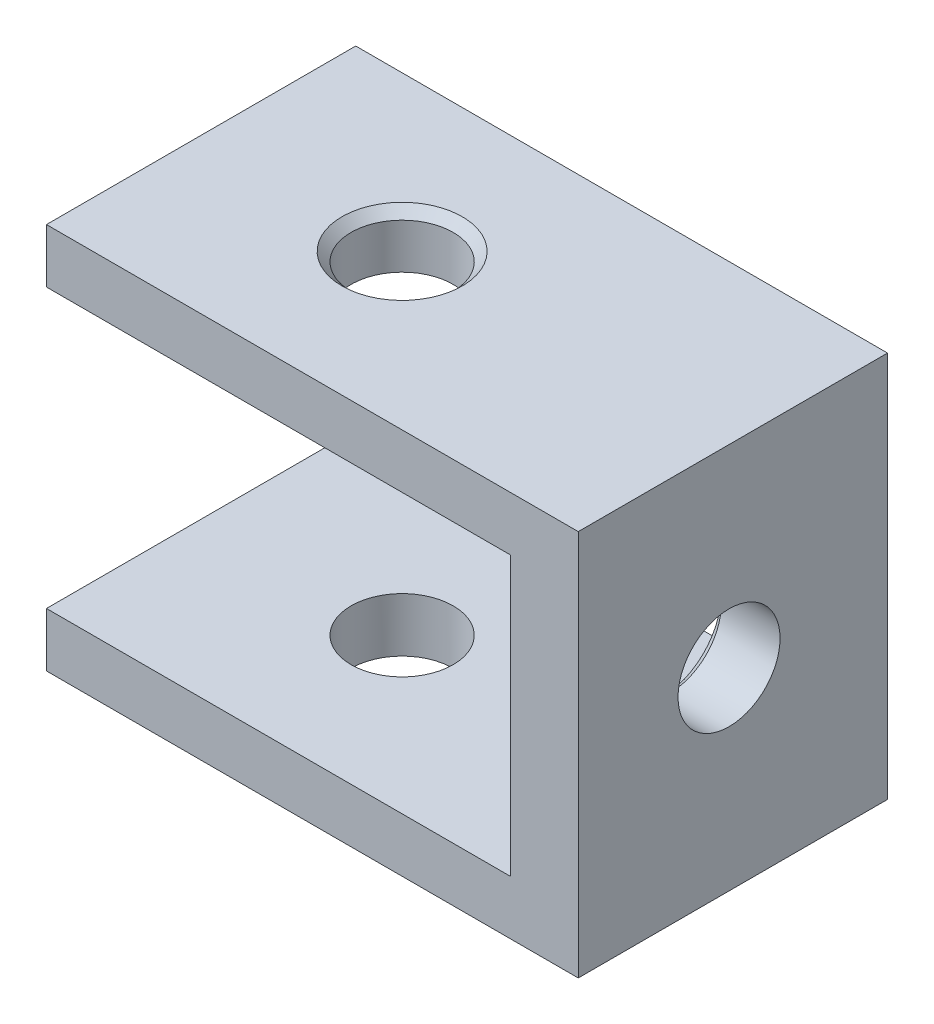
ISO-10303-21;
HEADER;
FILE_DESCRIPTION(('STEP AP214'),'2;1');
FILE_NAME('part.step','',(''),(''),'','','');
FILE_SCHEMA(('AUTOMOTIVE_DESIGN { 1 0 10303 214 1 1 1 1 }'));
ENDSEC;
DATA;
#1=APPLICATION_CONTEXT('core data for automotive mechanical design processes');
#2=APPLICATION_PROTOCOL_DEFINITION('international standard','automotive_design',2000,#1);
#3=PRODUCT_CONTEXT('',#1,'mechanical');
#4=PRODUCT('Part','Part','',(#3));
#5=PRODUCT_RELATED_PRODUCT_CATEGORY('part','',(#4));
#6=PRODUCT_DEFINITION_FORMATION('','',#4);
#7=PRODUCT_DEFINITION_CONTEXT('part definition',#1,'design');
#8=PRODUCT_DEFINITION('design','',#6,#7);
#9=PRODUCT_DEFINITION_SHAPE('','',#8);
#10=(LENGTH_UNIT() NAMED_UNIT(*) SI_UNIT(.MILLI.,.METRE.));
#11=(NAMED_UNIT(*) PLANE_ANGLE_UNIT() SI_UNIT($,.RADIAN.));
#12=(NAMED_UNIT(*) SI_UNIT($,.STERADIAN.) SOLID_ANGLE_UNIT());
#13=UNCERTAINTY_MEASURE_WITH_UNIT(LENGTH_MEASURE(1.E-05),#10,'distance_accuracy_value','');
#14=(GEOMETRIC_REPRESENTATION_CONTEXT(3) GLOBAL_UNCERTAINTY_ASSIGNED_CONTEXT((#13)) GLOBAL_UNIT_ASSIGNED_CONTEXT((#10,
#11,#12)) REPRESENTATION_CONTEXT('',''));
#15=CARTESIAN_POINT('',(0.,0.,0.));
#16=DIRECTION('',(0.,0.,1.));
#17=DIRECTION('',(1.,0.,0.));
#18=AXIS2_PLACEMENT_3D('',#15,#16,#17);
#19=CARTESIAN_POINT('',(-49.3903002128406,25.,9.75048362135415));
#20=DIRECTION('',(0.,0.,-1.));
#21=DIRECTION('',(-1.,0.,0.));
#22=AXIS2_PLACEMENT_3D('',#19,#20,#21);
#23=PLANE('',#22);
#24=DIRECTION('',(0.,1.,0.));
#25=VECTOR('',#24,1.);
#26=CARTESIAN_POINT('',(-15.,0.,9.75048362135415));
#27=LINE('',#26,#25);
#28=CARTESIAN_POINT('',(-15.,0.,9.75048362135415));
#29=VERTEX_POINT('',#28);
#30=CARTESIAN_POINT('',(-15.,25.,9.75048362135415));
#31=VERTEX_POINT('',#30);
#32=EDGE_CURVE('E56',#29,#31,#27,.T.);
#33=ORIENTED_EDGE('',*,*,#32,.T.);
#34=DIRECTION('',(1.,0.,0.));
#35=VECTOR('',#34,1.);
#36=CARTESIAN_POINT('',(-49.3903002128406,25.,9.75048362135415));
#37=LINE('',#36,#35);
#38=CARTESIAN_POINT('',(-49.3903002128406,25.,9.75048362135415));
#39=VERTEX_POINT('',#38);
#40=EDGE_CURVE('E116',#39,#31,#37,.T.);
#41=ORIENTED_EDGE('',*,*,#40,.F.);
#42=DIRECTION('',(0.,-1.,0.));
#43=VECTOR('',#42,1.);
#44=CARTESIAN_POINT('',(-49.3903002128406,25.,9.75048362135415));
#45=LINE('',#44,#43);
#46=CARTESIAN_POINT('',(-49.3903002128406,21.5,9.75048362135415));
#47=VERTEX_POINT('',#46);
#48=EDGE_CURVE('E49',#39,#47,#45,.T.);
#49=ORIENTED_EDGE('',*,*,#48,.T.);
#50=DIRECTION('',(-1.,0.,0.));
#51=VECTOR('',#50,1.);
#52=CARTESIAN_POINT('',(-19.3903002128406,21.5,9.75048362135415));
#53=LINE('',#52,#51);
#54=CARTESIAN_POINT('',(-19.3903002128406,21.5,9.75048362135415));
#55=VERTEX_POINT('',#54);
#56=EDGE_CURVE('E179',#55,#47,#53,.T.);
#57=ORIENTED_EDGE('',*,*,#56,.F.);
#58=DIRECTION('',(0.,1.,0.));
#59=VECTOR('',#58,1.);
#60=CARTESIAN_POINT('',(-19.3903002128406,21.5,9.75048362135415));
#61=LINE('',#60,#59);
#62=CARTESIAN_POINT('',(-19.3903002128406,3.5,9.75048362135415));
#63=VERTEX_POINT('',#62);
#64=EDGE_CURVE('E171',#63,#55,#61,.T.);
#65=ORIENTED_EDGE('',*,*,#64,.F.);
#66=DIRECTION('',(-1.,0.,0.));
#67=VECTOR('',#66,1.);
#68=CARTESIAN_POINT('',(-19.3903002128406,3.5,9.75048362135415));
#69=LINE('',#68,#67);
#70=CARTESIAN_POINT('',(-49.3903002128406,3.5,9.75048362135415));
#71=VERTEX_POINT('',#70);
#72=EDGE_CURVE('E181',#63,#71,#69,.T.);
#73=ORIENTED_EDGE('',*,*,#72,.T.);
#74=CARTESIAN_POINT('',(-49.3903002128406,0.,9.75048362135415));
#75=VERTEX_POINT('',#74);
#76=EDGE_CURVE('E143',#71,#75,#45,.T.);
#77=ORIENTED_EDGE('',*,*,#76,.T.);
#78=DIRECTION('',(1.,0.,0.));
#79=VECTOR('',#78,1.);
#80=CARTESIAN_POINT('',(-49.3903002128406,0.,9.75048362135415));
#81=LINE('',#80,#79);
#82=EDGE_CURVE('E119',#75,#29,#81,.T.);
#83=ORIENTED_EDGE('',*,*,#82,.T.);
#84=EDGE_LOOP('',(#33,#41,#49,#57,#65,#73,#77,#83));
#85=FACE_BOUND('',#84,.T.);
#86=ADVANCED_FACE('F40',(#85),#23,.F.);
#87=CARTESIAN_POINT('',(-49.3903002128406,25.,-10.2495163786458));
#88=DIRECTION('',(0.,0.,1.));
#89=DIRECTION('',(1.,0.,0.));
#90=AXIS2_PLACEMENT_3D('',#87,#88,#89);
#91=PLANE('',#90);
#92=DIRECTION('',(0.,1.,0.));
#93=VECTOR('',#92,1.);
#94=CARTESIAN_POINT('',(-15.,25.,-10.2495163786458));
#95=LINE('',#94,#93);
#96=CARTESIAN_POINT('',(-15.,0.,-10.2495163786458));
#97=VERTEX_POINT('',#96);
#98=CARTESIAN_POINT('',(-15.,25.,-10.2495163786458));
#99=VERTEX_POINT('',#98);
#100=EDGE_CURVE('E108',#97,#99,#95,.T.);
#101=ORIENTED_EDGE('',*,*,#100,.F.);
#102=DIRECTION('',(-1.,0.,0.));
#103=VECTOR('',#102,1.);
#104=CARTESIAN_POINT('',(-49.3903002128406,0.,-10.2495163786458));
#105=LINE('',#104,#103);
#106=CARTESIAN_POINT('',(-49.3903002128406,0.,-10.2495163786458));
#107=VERTEX_POINT('',#106);
#108=EDGE_CURVE('E130',#97,#107,#105,.T.);
#109=ORIENTED_EDGE('',*,*,#108,.T.);
#110=DIRECTION('',(0.,-1.,0.));
#111=VECTOR('',#110,1.);
#112=CARTESIAN_POINT('',(-49.3903002128406,25.,-10.2495163786458));
#113=LINE('',#112,#111);
#114=CARTESIAN_POINT('',(-49.3903002128406,3.5,-10.2495163786458));
#115=VERTEX_POINT('',#114);
#116=EDGE_CURVE('E128',#115,#107,#113,.T.);
#117=ORIENTED_EDGE('',*,*,#116,.F.);
#118=DIRECTION('',(-1.,0.,0.));
#119=VECTOR('',#118,1.);
#120=CARTESIAN_POINT('',(-19.3903002128406,3.5,-10.2495163786458));
#121=LINE('',#120,#119);
#122=CARTESIAN_POINT('',(-19.3903002128406,3.5,-10.2495163786458));
#123=VERTEX_POINT('',#122);
#124=EDGE_CURVE('E174',#123,#115,#121,.T.);
#125=ORIENTED_EDGE('',*,*,#124,.F.);
#126=DIRECTION('',(0.,-1.,0.));
#127=VECTOR('',#126,1.);
#128=CARTESIAN_POINT('',(-19.3903002128406,12.5,-10.2495163786458));
#129=LINE('',#128,#127);
#130=CARTESIAN_POINT('',(-19.3903002128406,21.5,-10.2495163786458));
#131=VERTEX_POINT('',#130);
#132=EDGE_CURVE('E165',#131,#123,#129,.T.);
#133=ORIENTED_EDGE('',*,*,#132,.F.);
#134=DIRECTION('',(-1.,0.,0.));
#135=VECTOR('',#134,1.);
#136=CARTESIAN_POINT('',(-19.3903002128406,21.5,-10.2495163786458));
#137=LINE('',#136,#135);
#138=CARTESIAN_POINT('',(-49.3903002128406,21.5,-10.2495163786458));
#139=VERTEX_POINT('',#138);
#140=EDGE_CURVE('E137',#131,#139,#137,.T.);
#141=ORIENTED_EDGE('',*,*,#140,.T.);
#142=CARTESIAN_POINT('',(-49.3903002128406,25.,-10.2495163786458));
#143=VERTEX_POINT('',#142);
#144=EDGE_CURVE('E140',#143,#139,#113,.T.);
#145=ORIENTED_EDGE('',*,*,#144,.F.);
#146=DIRECTION('',(-1.,0.,0.));
#147=VECTOR('',#146,1.);
#148=CARTESIAN_POINT('',(-49.3903002128406,25.,-10.2495163786458));
#149=LINE('',#148,#147);
#150=EDGE_CURVE('E126',#99,#143,#149,.T.);
#151=ORIENTED_EDGE('',*,*,#150,.F.);
#152=EDGE_LOOP('',(#101,#109,#117,#125,#133,#141,#145,#151));
#153=FACE_BOUND('',#152,.T.);
#154=ADVANCED_FACE('F194',(#153),#91,.F.);
#155=CARTESIAN_POINT('',(0.,25.,0.));
#156=DIRECTION('',(0.,1.,0.));
#157=DIRECTION('',(0.,0.,1.));
#158=AXIS2_PLACEMENT_3D('',#155,#156,#157);
#159=PLANE('',#158);
#160=CARTESIAN_POINT('',(-36.3903002128406,25.,-0.249516378645847));
#161=DIRECTION('',(0.,1.,0.));
#162=DIRECTION('',(0.,0.,1.));
#163=AXIS2_PLACEMENT_3D('',#160,#161,#162);
#164=CIRCLE('',#163,3.8865);
#165=CARTESIAN_POINT('',(-36.3903002128406,25.,3.63698362135415));
#166=VERTEX_POINT('',#165);
#167=EDGE_CURVE('E153',#166,#166,#164,.T.);
#168=ORIENTED_EDGE('',*,*,#167,.F.);
#169=EDGE_LOOP('',(#168));
#170=FACE_BOUND('',#169,.T.);
#171=ORIENTED_EDGE('',*,*,#40,.T.);
#172=DIRECTION('',(0.,0.,1.));
#173=VECTOR('',#172,1.);
#174=CARTESIAN_POINT('',(-15.,25.,-20.2495163786458));
#175=LINE('',#174,#173);
#176=EDGE_CURVE('E105',#99,#31,#175,.T.);
#177=ORIENTED_EDGE('',*,*,#176,.F.);
#178=ORIENTED_EDGE('',*,*,#150,.T.);
#179=DIRECTION('',(0.,0.,1.));
#180=VECTOR('',#179,1.);
#181=CARTESIAN_POINT('',(-49.3903002128406,25.,-10.2495163786458));
#182=LINE('',#181,#180);
#183=EDGE_CURVE('E124',#143,#39,#182,.T.);
#184=ORIENTED_EDGE('',*,*,#183,.T.);
#185=EDGE_LOOP('',(#171,#177,#178,#184));
#186=FACE_BOUND('',#185,.T.);
#187=ADVANCED_FACE('F122',(#170,#186),#159,.T.);
#188=CARTESIAN_POINT('',(0.,0.,0.));
#189=DIRECTION('',(0.,1.,0.));
#190=DIRECTION('',(0.,0.,1.));
#191=AXIS2_PLACEMENT_3D('',#188,#189,#190);
#192=PLANE('',#191);
#193=CARTESIAN_POINT('',(-36.3903002128406,0.,-0.249516378645847));
#194=DIRECTION('',(0.,1.,0.));
#195=DIRECTION('',(0.,0.,1.));
#196=AXIS2_PLACEMENT_3D('',#193,#194,#195);
#197=CIRCLE('',#196,3.3);
#198=CARTESIAN_POINT('',(-36.3903002128406,0.,3.05048362135415));
#199=VERTEX_POINT('',#198);
#200=EDGE_CURVE('E120',#199,#199,#197,.T.);
#201=ORIENTED_EDGE('',*,*,#200,.T.);
#202=EDGE_LOOP('',(#201));
#203=FACE_BOUND('',#202,.T.);
#204=DIRECTION('',(0.,0.,-1.));
#205=VECTOR('',#204,1.);
#206=CARTESIAN_POINT('',(-15.,0.,0.));
#207=LINE('',#206,#205);
#208=EDGE_CURVE('E11',#29,#97,#207,.T.);
#209=ORIENTED_EDGE('',*,*,#208,.F.);
#210=ORIENTED_EDGE('',*,*,#82,.F.);
#211=DIRECTION('',(0.,0.,1.));
#212=VECTOR('',#211,1.);
#213=CARTESIAN_POINT('',(-49.3903002128406,0.,-10.2495163786458));
#214=LINE('',#213,#212);
#215=EDGE_CURVE('E134',#107,#75,#214,.T.);
#216=ORIENTED_EDGE('',*,*,#215,.F.);
#217=ORIENTED_EDGE('',*,*,#108,.F.);
#218=EDGE_LOOP('',(#209,#210,#216,#217));
#219=FACE_BOUND('',#218,.T.);
#220=ADVANCED_FACE('F197',(#203,#219),#192,.F.);
#221=CARTESIAN_POINT('',(-49.3903002128406,25.,-10.2495163786458));
#222=DIRECTION('',(1.,0.,0.));
#223=DIRECTION('',(0.,0.,-1.));
#224=AXIS2_PLACEMENT_3D('',#221,#222,#223);
#225=PLANE('',#224);
#226=ORIENTED_EDGE('',*,*,#144,.T.);
#227=DIRECTION('',(0.,0.,-1.));
#228=VECTOR('',#227,1.);
#229=CARTESIAN_POINT('',(-49.3903002128406,21.5,-10.2495163786458));
#230=LINE('',#229,#228);
#231=EDGE_CURVE('E168',#47,#139,#230,.T.);
#232=ORIENTED_EDGE('',*,*,#231,.F.);
#233=ORIENTED_EDGE('',*,*,#48,.F.);
#234=ORIENTED_EDGE('',*,*,#183,.F.);
#235=EDGE_LOOP('',(#226,#232,#233,#234));
#236=FACE_BOUND('',#235,.T.);
#237=ADVANCED_FACE('F199',(#236),#225,.F.);
#238=ORIENTED_EDGE('',*,*,#76,.F.);
#239=DIRECTION('',(0.,0.,1.));
#240=VECTOR('',#239,1.);
#241=CARTESIAN_POINT('',(-49.3903002128406,3.5,9.75048362135415));
#242=LINE('',#241,#240);
#243=EDGE_CURVE('E164',#115,#71,#242,.T.);
#244=ORIENTED_EDGE('',*,*,#243,.F.);
#245=ORIENTED_EDGE('',*,*,#116,.T.);
#246=ORIENTED_EDGE('',*,*,#215,.T.);
#247=EDGE_LOOP('',(#238,#244,#245,#246));
#248=FACE_BOUND('',#247,.T.);
#249=ADVANCED_FACE('F42',(#248),#225,.F.);
#250=CARTESIAN_POINT('',(-19.3903002128406,21.5,-10.2495163786458));
#251=DIRECTION('',(0.,1.,0.));
#252=DIRECTION('',(0.,0.,1.));
#253=AXIS2_PLACEMENT_3D('',#250,#251,#252);
#254=PLANE('',#253);
#255=CARTESIAN_POINT('',(-36.3903002128406,21.5,-0.249516378645847));
#256=DIRECTION('',(0.,1.,0.));
#257=DIRECTION('',(0.,0.,1.));
#258=AXIS2_PLACEMENT_3D('',#255,#256,#257);
#259=CIRCLE('',#258,3.3);
#260=CARTESIAN_POINT('',(-36.3903002128406,21.5,3.05048362135415));
#261=VERTEX_POINT('',#260);
#262=EDGE_CURVE('E146',#261,#261,#259,.T.);
#263=ORIENTED_EDGE('',*,*,#262,.T.);
#264=EDGE_LOOP('',(#263));
#265=FACE_BOUND('',#264,.T.);
#266=ORIENTED_EDGE('',*,*,#231,.T.);
#267=ORIENTED_EDGE('',*,*,#140,.F.);
#268=DIRECTION('',(0.,0.,-1.));
#269=VECTOR('',#268,1.);
#270=CARTESIAN_POINT('',(-19.3903002128406,21.5,-10.2495163786458));
#271=LINE('',#270,#269);
#272=EDGE_CURVE('E64',#55,#131,#271,.T.);
#273=ORIENTED_EDGE('',*,*,#272,.F.);
#274=ORIENTED_EDGE('',*,*,#56,.T.);
#275=EDGE_LOOP('',(#266,#267,#273,#274));
#276=FACE_BOUND('',#275,.T.);
#277=ADVANCED_FACE('F230',(#265,#276),#254,.F.);
#278=CARTESIAN_POINT('',(-19.3903002128406,3.5,9.75048362135415));
#279=DIRECTION('',(0.,-1.,0.));
#280=DIRECTION('',(0.,0.,-1.));
#281=AXIS2_PLACEMENT_3D('',#278,#279,#280);
#282=PLANE('',#281);
#283=CARTESIAN_POINT('',(-36.3903002128406,3.5,-0.249516378645847));
#284=DIRECTION('',(0.,-1.,0.));
#285=DIRECTION('',(0.,0.,-1.));
#286=AXIS2_PLACEMENT_3D('',#283,#284,#285);
#287=CIRCLE('',#286,3.3);
#288=CARTESIAN_POINT('',(-36.3903002128406,3.5,-3.54951637864584));
#289=VERTEX_POINT('',#288);
#290=EDGE_CURVE('E144',#289,#289,#287,.T.);
#291=ORIENTED_EDGE('',*,*,#290,.T.);
#292=EDGE_LOOP('',(#291));
#293=FACE_BOUND('',#292,.T.);
#294=ORIENTED_EDGE('',*,*,#243,.T.);
#295=ORIENTED_EDGE('',*,*,#72,.F.);
#296=DIRECTION('',(0.,0.,1.));
#297=VECTOR('',#296,1.);
#298=CARTESIAN_POINT('',(-19.3903002128406,3.5,9.75048362135415));
#299=LINE('',#298,#297);
#300=EDGE_CURVE('E167',#123,#63,#299,.T.);
#301=ORIENTED_EDGE('',*,*,#300,.F.);
#302=ORIENTED_EDGE('',*,*,#124,.T.);
#303=EDGE_LOOP('',(#294,#295,#301,#302));
#304=FACE_BOUND('',#303,.T.);
#305=ADVANCED_FACE('F186',(#293,#304),#282,.F.);
#306=CARTESIAN_POINT('',(-19.3903002128406,0.,0.));
#307=DIRECTION('',(1.,0.,0.));
#308=DIRECTION('',(0.,0.,-1.));
#309=AXIS2_PLACEMENT_3D('',#306,#307,#308);
#310=PLANE('',#309);
#311=CARTESIAN_POINT('',(-19.3903002128406,12.5,0.));
#312=DIRECTION('',(-1.,0.,0.));
#313=DIRECTION('',(0.,0.,1.));
#314=AXIS2_PLACEMENT_3D('',#311,#312,#313);
#315=CIRCLE('',#314,3.8865);
#316=CARTESIAN_POINT('',(-19.3903002128406,12.5,3.8865));
#317=VERTEX_POINT('',#316);
#318=EDGE_CURVE('E326',#317,#317,#315,.T.);
#319=ORIENTED_EDGE('',*,*,#318,.F.);
#320=EDGE_LOOP('',(#319));
#321=FACE_BOUND('',#320,.T.);
#322=ORIENTED_EDGE('',*,*,#132,.T.);
#323=ORIENTED_EDGE('',*,*,#300,.T.);
#324=ORIENTED_EDGE('',*,*,#64,.T.);
#325=ORIENTED_EDGE('',*,*,#272,.T.);
#326=EDGE_LOOP('',(#322,#323,#324,#325));
#327=FACE_BOUND('',#326,.T.);
#328=ADVANCED_FACE('F246',(#321,#327),#310,.F.);
#329=CARTESIAN_POINT('',(-15.,0.,-20.2495163786458));
#330=DIRECTION('',(1.,0.,0.));
#331=DIRECTION('',(0.,0.,-1.));
#332=AXIS2_PLACEMENT_3D('',#329,#330,#331);
#333=PLANE('',#332);
#334=CARTESIAN_POINT('',(-15.,12.5,0.));
#335=DIRECTION('',(1.,0.,0.));
#336=DIRECTION('',(0.,0.,-1.));
#337=AXIS2_PLACEMENT_3D('',#334,#335,#336);
#338=CIRCLE('',#337,3.29999999999999);
#339=CARTESIAN_POINT('',(-15.,12.5,-3.29999999999999));
#340=VERTEX_POINT('',#339);
#341=EDGE_CURVE('E44',#340,#340,#338,.T.);
#342=ORIENTED_EDGE('',*,*,#341,.F.);
#343=EDGE_LOOP('',(#342));
#344=FACE_BOUND('',#343,.T.);
#345=ORIENTED_EDGE('',*,*,#100,.T.);
#346=ORIENTED_EDGE('',*,*,#176,.T.);
#347=ORIENTED_EDGE('',*,*,#32,.F.);
#348=ORIENTED_EDGE('',*,*,#208,.T.);
#349=EDGE_LOOP('',(#345,#346,#347,#348));
#350=FACE_BOUND('',#349,.T.);
#351=ADVANCED_FACE('F106',(#344,#350),#333,.T.);
#352=CARTESIAN_POINT('',(-36.3903002128406,25.,-0.249516378645847));
#353=DIRECTION('',(0.,1.,0.));
#354=DIRECTION('',(0.,0.,1.));
#355=AXIS2_PLACEMENT_3D('',#352,#353,#354);
#356=CYLINDRICAL_SURFACE('',#355,3.3);
#357=ORIENTED_EDGE('',*,*,#290,.F.);
#358=EDGE_LOOP('',(#357));
#359=FACE_BOUND('',#358,.T.);
#360=ORIENTED_EDGE('',*,*,#200,.F.);
#361=EDGE_LOOP('',(#360));
#362=FACE_BOUND('',#361,.T.);
#363=ADVANCED_FACE('F252',(#359,#362),#356,.F.);
#364=CARTESIAN_POINT('',(-36.3903002128406,24.4135,-0.249516378645847));
#365=DIRECTION('',(0.,1.,0.));
#366=DIRECTION('',(0.,0.,1.));
#367=AXIS2_PLACEMENT_3D('',#364,#365,#366);
#368=CIRCLE('',#367,3.3);
#369=CARTESIAN_POINT('',(-36.3903002128406,24.4135,3.05048362135415));
#370=VERTEX_POINT('',#369);
#371=EDGE_CURVE('E147',#370,#370,#368,.T.);
#372=ORIENTED_EDGE('',*,*,#371,.T.);
#373=EDGE_LOOP('',(#372));
#374=FACE_BOUND('',#373,.T.);
#375=ORIENTED_EDGE('',*,*,#262,.F.);
#376=EDGE_LOOP('',(#375));
#377=FACE_BOUND('',#376,.T.);
#378=ADVANCED_FACE('F258',(#374,#377),#356,.F.);
#379=CARTESIAN_POINT('',(-36.3903002128406,25.,-0.249516378645847));
#380=DIRECTION('',(0.,1.,0.));
#381=DIRECTION('',(0.,0.,1.));
#382=AXIS2_PLACEMENT_3D('',#379,#380,#381);
#383=CONICAL_SURFACE('',#382,3.8865,0.785398163397448);
#384=ORIENTED_EDGE('',*,*,#371,.F.);
#385=EDGE_LOOP('',(#384));
#386=FACE_BOUND('',#385,.T.);
#387=ORIENTED_EDGE('',*,*,#167,.T.);
#388=EDGE_LOOP('',(#387));
#389=FACE_BOUND('',#388,.T.);
#390=ADVANCED_FACE('F271',(#386,#389),#383,.F.);
#391=CARTESIAN_POINT('',(-19.3903002128406,12.5,0.));
#392=DIRECTION('',(-1.,0.,0.));
#393=DIRECTION('',(0.,0.,1.));
#394=AXIS2_PLACEMENT_3D('',#391,#392,#393);
#395=CYLINDRICAL_SURFACE('',#394,3.29999999999999);
#396=ORIENTED_EDGE('',*,*,#341,.T.);
#397=EDGE_LOOP('',(#396));
#398=FACE_BOUND('',#397,.T.);
#399=CARTESIAN_POINT('',(-18.8038002128406,12.5,0.));
#400=DIRECTION('',(-1.,0.,0.));
#401=DIRECTION('',(0.,0.,1.));
#402=AXIS2_PLACEMENT_3D('',#399,#400,#401);
#403=CIRCLE('',#402,3.29999999999999);
#404=CARTESIAN_POINT('',(-18.8038002128406,12.5,3.29999999999999));
#405=VERTEX_POINT('',#404);
#406=EDGE_CURVE('E323',#405,#405,#403,.T.);
#407=ORIENTED_EDGE('',*,*,#406,.T.);
#408=EDGE_LOOP('',(#407));
#409=FACE_BOUND('',#408,.T.);
#410=ADVANCED_FACE('F279',(#398,#409),#395,.F.);
#411=CARTESIAN_POINT('',(-19.3903002128406,12.5,0.));
#412=DIRECTION('',(-1.,0.,0.));
#413=DIRECTION('',(0.,0.,1.));
#414=AXIS2_PLACEMENT_3D('',#411,#412,#413);
#415=CONICAL_SURFACE('',#414,3.8865,0.785398163397439);
#416=ORIENTED_EDGE('',*,*,#406,.F.);
#417=EDGE_LOOP('',(#416));
#418=FACE_BOUND('',#417,.T.);
#419=ORIENTED_EDGE('',*,*,#318,.T.);
#420=EDGE_LOOP('',(#419));
#421=FACE_BOUND('',#420,.T.);
#422=ADVANCED_FACE('F305',(#418,#421),#415,.F.);
#423=CLOSED_SHELL('',(#86,#154,#187,#220,#237,#249,#277,#305,#328,#351,#363,#378,#390,#410,#422));
#424=MANIFOLD_SOLID_BREP('B2',#423);
#425=ADVANCED_BREP_SHAPE_REPRESENTATION('',(#18,#424),#14);
#426=SHAPE_DEFINITION_REPRESENTATION(#9,#425);
ENDSEC;
END-ISO-10303-21;
